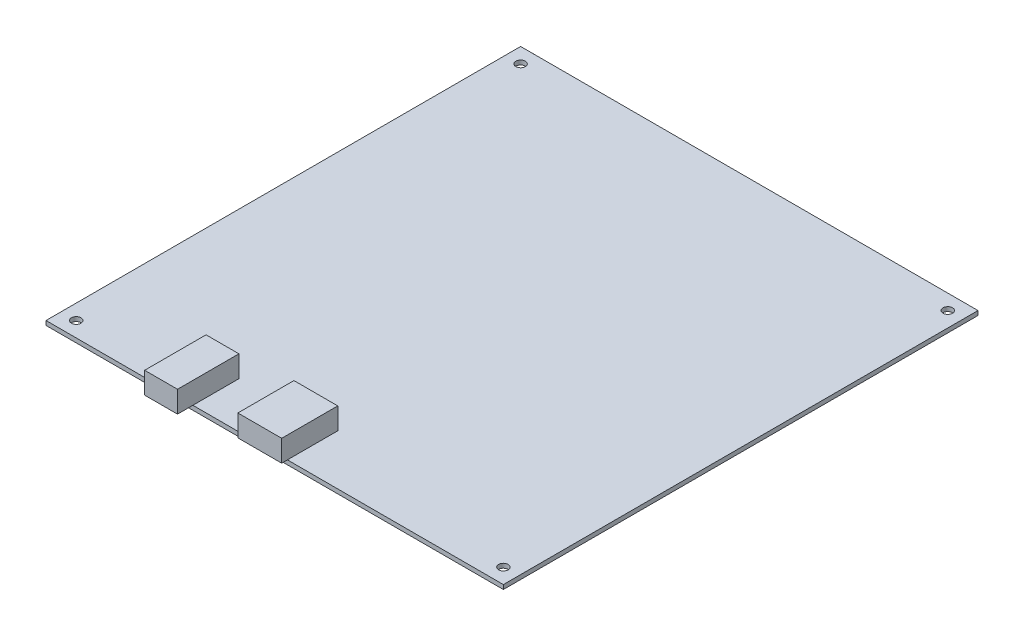
ISO-10303-21;
HEADER;
FILE_DESCRIPTION(('STEP AP214'),'2;1');
FILE_NAME('part.step','',(''),(''),'','','');
FILE_SCHEMA(('AUTOMOTIVE_DESIGN { 1 0 10303 214 1 1 1 1 }'));
ENDSEC;
DATA;
#1=APPLICATION_CONTEXT('core data for automotive mechanical design processes');
#2=APPLICATION_PROTOCOL_DEFINITION('international standard','automotive_design',2000,#1);
#3=PRODUCT_CONTEXT('',#1,'mechanical');
#4=PRODUCT('Part','Part','',(#3));
#5=PRODUCT_RELATED_PRODUCT_CATEGORY('part','',(#4));
#6=PRODUCT_DEFINITION_FORMATION('','',#4);
#7=PRODUCT_DEFINITION_CONTEXT('part definition',#1,'design');
#8=PRODUCT_DEFINITION('design','',#6,#7);
#9=PRODUCT_DEFINITION_SHAPE('','',#8);
#10=(LENGTH_UNIT() NAMED_UNIT(*) SI_UNIT(.MILLI.,.METRE.));
#11=(NAMED_UNIT(*) PLANE_ANGLE_UNIT() SI_UNIT($,.RADIAN.));
#12=(NAMED_UNIT(*) SI_UNIT($,.STERADIAN.) SOLID_ANGLE_UNIT());
#13=UNCERTAINTY_MEASURE_WITH_UNIT(LENGTH_MEASURE(1.E-05),#10,'distance_accuracy_value','');
#14=(GEOMETRIC_REPRESENTATION_CONTEXT(3) GLOBAL_UNCERTAINTY_ASSIGNED_CONTEXT((#13)) GLOBAL_UNIT_ASSIGNED_CONTEXT((#10,
#11,#12)) REPRESENTATION_CONTEXT('',''));
#15=CARTESIAN_POINT('',(0.,0.,0.));
#16=DIRECTION('',(0.,0.,1.));
#17=DIRECTION('',(1.,0.,0.));
#18=AXIS2_PLACEMENT_3D('',#15,#16,#17);
#19=CARTESIAN_POINT('',(-44.0442723681258,1.,10.0561799951606));
#20=DIRECTION('',(0.,1.,0.));
#21=DIRECTION('',(0.,0.,1.));
#22=AXIS2_PLACEMENT_3D('',#19,#20,#21);
#23=PLANE('',#22);
#24=CARTESIAN_POINT('',(58.4557276318742,1.,-96.4438200048394));
#25=DIRECTION('',(0.,1.,0.));
#26=DIRECTION('',(0.,0.,1.));
#27=AXIS2_PLACEMENT_3D('',#24,#25,#26);
#28=CIRCLE('',#27,1.10000000000001);
#29=CARTESIAN_POINT('',(58.4557276318742,1.,-95.3438200048394));
#30=VERTEX_POINT('',#29);
#31=EDGE_CURVE('E196',#30,#30,#28,.T.);
#32=ORIENTED_EDGE('',*,*,#31,.F.);
#33=EDGE_LOOP('',(#32));
#34=FACE_BOUND('',#33,.T.);
#35=CARTESIAN_POINT('',(58.4557276318742,1.,6.55617999516062));
#36=DIRECTION('',(0.,1.,0.));
#37=DIRECTION('',(0.,0.,1.));
#38=AXIS2_PLACEMENT_3D('',#35,#36,#37);
#39=CIRCLE('',#38,1.10000000000001);
#40=CARTESIAN_POINT('',(58.4557276318742,1.,7.65617999516062));
#41=VERTEX_POINT('',#40);
#42=EDGE_CURVE('E208',#41,#41,#39,.T.);
#43=ORIENTED_EDGE('',*,*,#42,.F.);
#44=EDGE_LOOP('',(#43));
#45=FACE_BOUND('',#44,.T.);
#46=CARTESIAN_POINT('',(-40.5442723681258,1.,6.55617999516062));
#47=DIRECTION('',(0.,1.,0.));
#48=DIRECTION('',(0.,0.,1.));
#49=AXIS2_PLACEMENT_3D('',#46,#47,#48);
#50=CIRCLE('',#49,1.10000000000001);
#51=CARTESIAN_POINT('',(-40.5442723681258,1.,7.65617999516063));
#52=VERTEX_POINT('',#51);
#53=EDGE_CURVE('E214',#52,#52,#50,.T.);
#54=ORIENTED_EDGE('',*,*,#53,.F.);
#55=EDGE_LOOP('',(#54));
#56=FACE_BOUND('',#55,.T.);
#57=CARTESIAN_POINT('',(-40.5442723681258,1.,-96.4438200048394));
#58=DIRECTION('',(0.,1.,0.));
#59=DIRECTION('',(0.,0.,1.));
#60=AXIS2_PLACEMENT_3D('',#57,#58,#59);
#61=CIRCLE('',#60,1.10000000000001);
#62=CARTESIAN_POINT('',(-40.5442723681258,1.,-95.3438200048394));
#63=VERTEX_POINT('',#62);
#64=EDGE_CURVE('E202',#63,#63,#61,.T.);
#65=ORIENTED_EDGE('',*,*,#64,.F.);
#66=EDGE_LOOP('',(#65));
#67=FACE_BOUND('',#66,.T.);
#68=DIRECTION('',(1.,0.,0.));
#69=VECTOR('',#68,1.);
#70=CARTESIAN_POINT('',(-44.0442723681258,1.,10.0561799951606));
#71=LINE('',#70,#69);
#72=CARTESIAN_POINT('',(-10.0042723681258,1.,10.0561799951606));
#73=VERTEX_POINT('',#72);
#74=CARTESIAN_POINT('',(1.74572763187419,1.,10.0561799951606));
#75=VERTEX_POINT('',#74);
#76=EDGE_CURVE('E272',#73,#75,#71,.T.);
#77=ORIENTED_EDGE('',*,*,#76,.T.);
#78=DIRECTION('',(0.,0.,1.));
#79=VECTOR('',#78,1.);
#80=CARTESIAN_POINT('',(1.74572763187418,1.,-1.61382000483938));
#81=LINE('',#80,#79);
#82=CARTESIAN_POINT('',(1.74572763187419,1.,-1.61382000483938));
#83=VERTEX_POINT('',#82);
#84=EDGE_CURVE('E56',#83,#75,#81,.T.);
#85=ORIENTED_EDGE('',*,*,#84,.F.);
#86=DIRECTION('',(-1.,0.,0.));
#87=VECTOR('',#86,1.);
#88=CARTESIAN_POINT('',(1.74572763187418,1.,-1.61382000483938));
#89=LINE('',#88,#87);
#90=CARTESIAN_POINT('',(11.9057276318742,1.,-1.61382000483938));
#91=VERTEX_POINT('',#90);
#92=EDGE_CURVE('E51',#91,#83,#89,.T.);
#93=ORIENTED_EDGE('',*,*,#92,.F.);
#94=DIRECTION('',(0.,0.,-1.));
#95=VECTOR('',#94,1.);
#96=CARTESIAN_POINT('',(11.9057276318742,1.,-1.61382000483938));
#97=LINE('',#96,#95);
#98=CARTESIAN_POINT('',(11.9057276318742,1.,10.0561799951606));
#99=VERTEX_POINT('',#98);
#100=EDGE_CURVE('E269',#99,#91,#97,.T.);
#101=ORIENTED_EDGE('',*,*,#100,.F.);
#102=CARTESIAN_POINT('',(61.9557276318742,1.,10.0561799951606));
#103=VERTEX_POINT('',#102);
#104=EDGE_CURVE('E223',#99,#103,#71,.T.);
#105=ORIENTED_EDGE('',*,*,#104,.T.);
#106=DIRECTION('',(0.,0.,-1.));
#107=VECTOR('',#106,1.);
#108=CARTESIAN_POINT('',(61.9557276318742,1.,-99.9438200048394));
#109=LINE('',#108,#107);
#110=CARTESIAN_POINT('',(61.9557276318742,1.,-99.9438200048394));
#111=VERTEX_POINT('',#110);
#112=EDGE_CURVE('E227',#103,#111,#109,.T.);
#113=ORIENTED_EDGE('',*,*,#112,.T.);
#114=DIRECTION('',(-1.,0.,0.));
#115=VECTOR('',#114,1.);
#116=CARTESIAN_POINT('',(-44.0442723681258,1.,-99.9438200048394));
#117=LINE('',#116,#115);
#118=CARTESIAN_POINT('',(-44.0442723681258,1.,-99.9438200048394));
#119=VERTEX_POINT('',#118);
#120=EDGE_CURVE('E230',#111,#119,#117,.T.);
#121=ORIENTED_EDGE('',*,*,#120,.T.);
#122=DIRECTION('',(0.,0.,1.));
#123=VECTOR('',#122,1.);
#124=CARTESIAN_POINT('',(-44.0442723681258,1.,-99.9438200048394));
#125=LINE('',#124,#123);
#126=CARTESIAN_POINT('',(-44.0442723681258,1.,10.0561799951606));
#127=VERTEX_POINT('',#126);
#128=EDGE_CURVE('E220',#119,#127,#125,.T.);
#129=ORIENTED_EDGE('',*,*,#128,.T.);
#130=CARTESIAN_POINT('',(-17.6242723681258,1.,10.0561799951606));
#131=VERTEX_POINT('',#130);
#132=EDGE_CURVE('E225',#127,#131,#71,.T.);
#133=ORIENTED_EDGE('',*,*,#132,.T.);
#134=DIRECTION('',(0.,0.,1.));
#135=VECTOR('',#134,1.);
#136=CARTESIAN_POINT('',(-17.6242723681258,1.,-0.613820004839382));
#137=LINE('',#136,#135);
#138=CARTESIAN_POINT('',(-17.6242723681258,1.,-0.613820004839382));
#139=VERTEX_POINT('',#138);
#140=EDGE_CURVE('E180',#139,#131,#137,.T.);
#141=ORIENTED_EDGE('',*,*,#140,.F.);
#142=DIRECTION('',(-1.,0.,0.));
#143=VECTOR('',#142,1.);
#144=CARTESIAN_POINT('',(-17.6242723681258,1.,-0.613820004839382));
#145=LINE('',#144,#143);
#146=CARTESIAN_POINT('',(-10.0042723681258,1.,-0.613820004839382));
#147=VERTEX_POINT('',#146);
#148=EDGE_CURVE('E173',#147,#139,#145,.T.);
#149=ORIENTED_EDGE('',*,*,#148,.F.);
#150=DIRECTION('',(0.,0.,-1.));
#151=VECTOR('',#150,1.);
#152=CARTESIAN_POINT('',(-10.0042723681258,1.,-0.613820004839382));
#153=LINE('',#152,#151);
#154=EDGE_CURVE('E12',#73,#147,#153,.T.);
#155=ORIENTED_EDGE('',*,*,#154,.F.);
#156=EDGE_LOOP('',(#77,#85,#93,#101,#105,#113,#121,#129,#133,#141,#149,#155));
#157=FACE_BOUND('',#156,.T.);
#158=ADVANCED_FACE('F35',(#34,#45,#56,#67,#157),#23,.T.);
#159=CARTESIAN_POINT('',(-44.0442723681258,0.,10.0561799951606));
#160=DIRECTION('',(0.,1.,0.));
#161=DIRECTION('',(0.,0.,1.));
#162=AXIS2_PLACEMENT_3D('',#159,#160,#161);
#163=PLANE('',#162);
#164=CARTESIAN_POINT('',(-40.5442723681258,0.,-96.4438200048394));
#165=DIRECTION('',(0.,1.,0.));
#166=DIRECTION('',(0.,0.,1.));
#167=AXIS2_PLACEMENT_3D('',#164,#165,#166);
#168=CIRCLE('',#167,1.10000000000001);
#169=CARTESIAN_POINT('',(-40.5442723681258,0.,-95.3438200048394));
#170=VERTEX_POINT('',#169);
#171=EDGE_CURVE('E199',#170,#170,#168,.T.);
#172=ORIENTED_EDGE('',*,*,#171,.T.);
#173=EDGE_LOOP('',(#172));
#174=FACE_BOUND('',#173,.T.);
#175=CARTESIAN_POINT('',(-40.5442723681258,0.,6.55617999516062));
#176=DIRECTION('',(0.,1.,0.));
#177=DIRECTION('',(0.,0.,1.));
#178=AXIS2_PLACEMENT_3D('',#175,#176,#177);
#179=CIRCLE('',#178,1.10000000000001);
#180=CARTESIAN_POINT('',(-40.5442723681258,0.,7.65617999516063));
#181=VERTEX_POINT('',#180);
#182=EDGE_CURVE('E211',#181,#181,#179,.T.);
#183=ORIENTED_EDGE('',*,*,#182,.T.);
#184=EDGE_LOOP('',(#183));
#185=FACE_BOUND('',#184,.T.);
#186=DIRECTION('',(0.,0.,1.));
#187=VECTOR('',#186,1.);
#188=CARTESIAN_POINT('',(-44.0442723681258,0.,-99.9438200048394));
#189=LINE('',#188,#187);
#190=CARTESIAN_POINT('',(-44.0442723681258,0.,-99.9438200048394));
#191=VERTEX_POINT('',#190);
#192=CARTESIAN_POINT('',(-44.0442723681258,0.,10.0561799951606));
#193=VERTEX_POINT('',#192);
#194=EDGE_CURVE('E217',#191,#193,#189,.T.);
#195=ORIENTED_EDGE('',*,*,#194,.F.);
#196=DIRECTION('',(-1.,0.,0.));
#197=VECTOR('',#196,1.);
#198=CARTESIAN_POINT('',(-44.0442723681258,0.,-99.9438200048394));
#199=LINE('',#198,#197);
#200=CARTESIAN_POINT('',(61.9557276318742,0.,-99.9438200048394));
#201=VERTEX_POINT('',#200);
#202=EDGE_CURVE('E224',#201,#191,#199,.T.);
#203=ORIENTED_EDGE('',*,*,#202,.F.);
#204=DIRECTION('',(0.,0.,-1.));
#205=VECTOR('',#204,1.);
#206=CARTESIAN_POINT('',(61.9557276318742,0.,-99.9438200048394));
#207=LINE('',#206,#205);
#208=CARTESIAN_POINT('',(61.9557276318742,0.,10.0561799951606));
#209=VERTEX_POINT('',#208);
#210=EDGE_CURVE('E237',#209,#201,#207,.T.);
#211=ORIENTED_EDGE('',*,*,#210,.F.);
#212=DIRECTION('',(1.,0.,0.));
#213=VECTOR('',#212,1.);
#214=CARTESIAN_POINT('',(-44.0442723681258,0.,10.0561799951606));
#215=LINE('',#214,#213);
#216=EDGE_CURVE('E235',#193,#209,#215,.T.);
#217=ORIENTED_EDGE('',*,*,#216,.F.);
#218=EDGE_LOOP('',(#195,#203,#211,#217));
#219=FACE_BOUND('',#218,.T.);
#220=CARTESIAN_POINT('',(58.4557276318742,0.,6.55617999516062));
#221=DIRECTION('',(0.,1.,0.));
#222=DIRECTION('',(0.,0.,1.));
#223=AXIS2_PLACEMENT_3D('',#220,#221,#222);
#224=CIRCLE('',#223,1.10000000000001);
#225=CARTESIAN_POINT('',(58.4557276318742,0.,7.65617999516062));
#226=VERTEX_POINT('',#225);
#227=EDGE_CURVE('E205',#226,#226,#224,.T.);
#228=ORIENTED_EDGE('',*,*,#227,.T.);
#229=EDGE_LOOP('',(#228));
#230=FACE_BOUND('',#229,.T.);
#231=CARTESIAN_POINT('',(58.4557276318742,0.,-96.4438200048394));
#232=DIRECTION('',(0.,1.,0.));
#233=DIRECTION('',(0.,0.,1.));
#234=AXIS2_PLACEMENT_3D('',#231,#232,#233);
#235=CIRCLE('',#234,1.10000000000001);
#236=CARTESIAN_POINT('',(58.4557276318742,0.,-95.3438200048394));
#237=VERTEX_POINT('',#236);
#238=EDGE_CURVE('E183',#237,#237,#235,.T.);
#239=ORIENTED_EDGE('',*,*,#238,.T.);
#240=EDGE_LOOP('',(#239));
#241=FACE_BOUND('',#240,.T.);
#242=ADVANCED_FACE('F259',(#174,#185,#219,#230,#241),#163,.F.);
#243=CARTESIAN_POINT('',(-44.0442723681258,1.,-99.9438200048394));
#244=DIRECTION('',(1.,0.,0.));
#245=DIRECTION('',(0.,0.,-1.));
#246=AXIS2_PLACEMENT_3D('',#243,#244,#245);
#247=PLANE('',#246);
#248=ORIENTED_EDGE('',*,*,#194,.T.);
#249=DIRECTION('',(0.,-1.,0.));
#250=VECTOR('',#249,1.);
#251=CARTESIAN_POINT('',(-44.0442723681258,1.,10.0561799951606));
#252=LINE('',#251,#250);
#253=EDGE_CURVE('E44',#127,#193,#252,.T.);
#254=ORIENTED_EDGE('',*,*,#253,.F.);
#255=ORIENTED_EDGE('',*,*,#128,.F.);
#256=DIRECTION('',(0.,-1.,0.));
#257=VECTOR('',#256,1.);
#258=CARTESIAN_POINT('',(-44.0442723681258,1.,-99.9438200048394));
#259=LINE('',#258,#257);
#260=EDGE_CURVE('E232',#119,#191,#259,.T.);
#261=ORIENTED_EDGE('',*,*,#260,.T.);
#262=EDGE_LOOP('',(#248,#254,#255,#261));
#263=FACE_BOUND('',#262,.T.);
#264=ADVANCED_FACE('F37',(#263),#247,.F.);
#265=CARTESIAN_POINT('',(-44.0442723681258,1.,10.0561799951606));
#266=DIRECTION('',(0.,0.,-1.));
#267=DIRECTION('',(-1.,0.,0.));
#268=AXIS2_PLACEMENT_3D('',#265,#266,#267);
#269=PLANE('',#268);
#270=ORIENTED_EDGE('',*,*,#216,.T.);
#271=DIRECTION('',(0.,-1.,0.));
#272=VECTOR('',#271,1.);
#273=CARTESIAN_POINT('',(61.9557276318742,1.,10.0561799951606));
#274=LINE('',#273,#272);
#275=EDGE_CURVE('E245',#103,#209,#274,.T.);
#276=ORIENTED_EDGE('',*,*,#275,.F.);
#277=ORIENTED_EDGE('',*,*,#104,.F.);
#278=EDGE_CURVE('E271',#75,#99,#71,.T.);
#279=ORIENTED_EDGE('',*,*,#278,.F.);
#280=ORIENTED_EDGE('',*,*,#76,.F.);
#281=EDGE_CURVE('E228',#131,#73,#71,.T.);
#282=ORIENTED_EDGE('',*,*,#281,.F.);
#283=ORIENTED_EDGE('',*,*,#132,.F.);
#284=ORIENTED_EDGE('',*,*,#253,.T.);
#285=EDGE_LOOP('',(#270,#276,#277,#279,#280,#282,#283,#284));
#286=FACE_BOUND('',#285,.T.);
#287=ADVANCED_FACE('F250',(#286),#269,.F.);
#288=CARTESIAN_POINT('',(61.9557276318742,1.,-99.9438200048394));
#289=DIRECTION('',(-1.,0.,0.));
#290=DIRECTION('',(0.,0.,1.));
#291=AXIS2_PLACEMENT_3D('',#288,#289,#290);
#292=PLANE('',#291);
#293=ORIENTED_EDGE('',*,*,#210,.T.);
#294=DIRECTION('',(0.,-1.,0.));
#295=VECTOR('',#294,1.);
#296=CARTESIAN_POINT('',(61.9557276318742,1.,-99.9438200048394));
#297=LINE('',#296,#295);
#298=EDGE_CURVE('E242',#111,#201,#297,.T.);
#299=ORIENTED_EDGE('',*,*,#298,.F.);
#300=ORIENTED_EDGE('',*,*,#112,.F.);
#301=ORIENTED_EDGE('',*,*,#275,.T.);
#302=EDGE_LOOP('',(#293,#299,#300,#301));
#303=FACE_BOUND('',#302,.T.);
#304=ADVANCED_FACE('F264',(#303),#292,.F.);
#305=CARTESIAN_POINT('',(-44.0442723681258,1.,-99.9438200048394));
#306=DIRECTION('',(0.,0.,1.));
#307=DIRECTION('',(1.,0.,0.));
#308=AXIS2_PLACEMENT_3D('',#305,#306,#307);
#309=PLANE('',#308);
#310=ORIENTED_EDGE('',*,*,#202,.T.);
#311=ORIENTED_EDGE('',*,*,#260,.F.);
#312=ORIENTED_EDGE('',*,*,#120,.F.);
#313=ORIENTED_EDGE('',*,*,#298,.T.);
#314=EDGE_LOOP('',(#310,#311,#312,#313));
#315=FACE_BOUND('',#314,.T.);
#316=ADVANCED_FACE('F268',(#315),#309,.F.);
#317=CARTESIAN_POINT('',(-40.5442723681258,1.,6.55617999516062));
#318=DIRECTION('',(0.,-1.,0.));
#319=DIRECTION('',(0.,0.,-1.));
#320=AXIS2_PLACEMENT_3D('',#317,#318,#319);
#321=CYLINDRICAL_SURFACE('',#320,1.10000000000001);
#322=ORIENTED_EDGE('',*,*,#53,.T.);
#323=EDGE_LOOP('',(#322));
#324=FACE_BOUND('',#323,.T.);
#325=ORIENTED_EDGE('',*,*,#182,.F.);
#326=EDGE_LOOP('',(#325));
#327=FACE_BOUND('',#326,.T.);
#328=ADVANCED_FACE('F353',(#324,#327),#321,.F.);
#329=CARTESIAN_POINT('',(58.4557276318742,1.,6.55617999516062));
#330=DIRECTION('',(0.,-1.,0.));
#331=DIRECTION('',(0.,0.,-1.));
#332=AXIS2_PLACEMENT_3D('',#329,#330,#331);
#333=CYLINDRICAL_SURFACE('',#332,1.10000000000001);
#334=ORIENTED_EDGE('',*,*,#42,.T.);
#335=EDGE_LOOP('',(#334));
#336=FACE_BOUND('',#335,.T.);
#337=ORIENTED_EDGE('',*,*,#227,.F.);
#338=EDGE_LOOP('',(#337));
#339=FACE_BOUND('',#338,.T.);
#340=ADVANCED_FACE('F396',(#336,#339),#333,.F.);
#341=CARTESIAN_POINT('',(-40.5442723681258,1.,-96.4438200048394));
#342=DIRECTION('',(0.,-1.,0.));
#343=DIRECTION('',(0.,0.,-1.));
#344=AXIS2_PLACEMENT_3D('',#341,#342,#343);
#345=CYLINDRICAL_SURFACE('',#344,1.10000000000001);
#346=ORIENTED_EDGE('',*,*,#64,.T.);
#347=EDGE_LOOP('',(#346));
#348=FACE_BOUND('',#347,.T.);
#349=ORIENTED_EDGE('',*,*,#171,.F.);
#350=EDGE_LOOP('',(#349));
#351=FACE_BOUND('',#350,.T.);
#352=ADVANCED_FACE('F404',(#348,#351),#345,.F.);
#353=CARTESIAN_POINT('',(58.4557276318742,1.,-96.4438200048394));
#354=DIRECTION('',(0.,-1.,0.));
#355=DIRECTION('',(0.,0.,-1.));
#356=AXIS2_PLACEMENT_3D('',#353,#354,#355);
#357=CYLINDRICAL_SURFACE('',#356,1.10000000000001);
#358=ORIENTED_EDGE('',*,*,#31,.T.);
#359=EDGE_LOOP('',(#358));
#360=FACE_BOUND('',#359,.T.);
#361=ORIENTED_EDGE('',*,*,#238,.F.);
#362=EDGE_LOOP('',(#361));
#363=FACE_BOUND('',#362,.T.);
#364=ADVANCED_FACE('F341',(#360,#363),#357,.F.);
#365=CARTESIAN_POINT('',(-39.5117966688814,1.,6.50117999516062));
#366=DIRECTION('',(0.,1.,0.));
#367=DIRECTION('',(0.,0.,1.));
#368=AXIS2_PLACEMENT_3D('',#365,#366,#367);
#369=PLANE('',#368);
#370=CARTESIAN_POINT('',(-17.6242723681258,1.,13.6161799951606));
#371=VERTEX_POINT('',#370);
#372=EDGE_CURVE('E184',#131,#371,#137,.T.);
#373=ORIENTED_EDGE('',*,*,#372,.F.);
#374=ORIENTED_EDGE('',*,*,#281,.T.);
#375=CARTESIAN_POINT('',(-10.0042723681258,1.,13.6161799951606));
#376=VERTEX_POINT('',#375);
#377=EDGE_CURVE('E283',#376,#73,#153,.T.);
#378=ORIENTED_EDGE('',*,*,#377,.F.);
#379=DIRECTION('',(1.,0.,0.));
#380=VECTOR('',#379,1.);
#381=CARTESIAN_POINT('',(-17.6242723681258,1.,13.6161799951606));
#382=LINE('',#381,#380);
#383=EDGE_CURVE('E316',#371,#376,#382,.T.);
#384=ORIENTED_EDGE('',*,*,#383,.F.);
#385=EDGE_LOOP('',(#373,#374,#378,#384));
#386=FACE_BOUND('',#385,.T.);
#387=ADVANCED_FACE('F281',(#386),#369,.F.);
#388=CARTESIAN_POINT('',(-39.5117966688814,6.,6.50117999516062));
#389=DIRECTION('',(0.,1.,0.));
#390=DIRECTION('',(0.,0.,1.));
#391=AXIS2_PLACEMENT_3D('',#388,#389,#390);
#392=PLANE('',#391);
#393=DIRECTION('',(-1.,0.,0.));
#394=VECTOR('',#393,1.);
#395=CARTESIAN_POINT('',(-17.6242723681258,6.,-0.613820004839382));
#396=LINE('',#395,#394);
#397=CARTESIAN_POINT('',(-10.0042723681258,6.,-0.613820004839382));
#398=VERTEX_POINT('',#397);
#399=CARTESIAN_POINT('',(-17.6242723681258,6.,-0.613820004839382));
#400=VERTEX_POINT('',#399);
#401=EDGE_CURVE('E161',#398,#400,#396,.T.);
#402=ORIENTED_EDGE('',*,*,#401,.T.);
#403=DIRECTION('',(0.,0.,1.));
#404=VECTOR('',#403,1.);
#405=CARTESIAN_POINT('',(-17.6242723681258,6.,-0.613820004839382));
#406=LINE('',#405,#404);
#407=CARTESIAN_POINT('',(-17.6242723681258,6.,13.6161799951606));
#408=VERTEX_POINT('',#407);
#409=EDGE_CURVE('E193',#400,#408,#406,.T.);
#410=ORIENTED_EDGE('',*,*,#409,.T.);
#411=DIRECTION('',(1.,0.,0.));
#412=VECTOR('',#411,1.);
#413=CARTESIAN_POINT('',(-17.6242723681258,6.,13.6161799951606));
#414=LINE('',#413,#412);
#415=CARTESIAN_POINT('',(-10.0042723681258,6.,13.6161799951606));
#416=VERTEX_POINT('',#415);
#417=EDGE_CURVE('E293',#408,#416,#414,.T.);
#418=ORIENTED_EDGE('',*,*,#417,.T.);
#419=DIRECTION('',(0.,0.,-1.));
#420=VECTOR('',#419,1.);
#421=CARTESIAN_POINT('',(-10.0042723681258,6.,-0.613820004839382));
#422=LINE('',#421,#420);
#423=EDGE_CURVE('E172',#416,#398,#422,.T.);
#424=ORIENTED_EDGE('',*,*,#423,.T.);
#425=EDGE_LOOP('',(#402,#410,#418,#424));
#426=FACE_BOUND('',#425,.T.);
#427=ADVANCED_FACE('F310',(#426),#392,.T.);
#428=CARTESIAN_POINT('',(-17.6242723681258,1.,-0.613820004839382));
#429=DIRECTION('',(0.,0.,-1.));
#430=DIRECTION('',(-1.,0.,0.));
#431=AXIS2_PLACEMENT_3D('',#428,#429,#430);
#432=PLANE('',#431);
#433=ORIENTED_EDGE('',*,*,#401,.F.);
#434=DIRECTION('',(0.,1.,0.));
#435=VECTOR('',#434,1.);
#436=CARTESIAN_POINT('',(-10.0042723681258,1.,-0.613820004839382));
#437=LINE('',#436,#435);
#438=EDGE_CURVE('E163',#147,#398,#437,.T.);
#439=ORIENTED_EDGE('',*,*,#438,.F.);
#440=ORIENTED_EDGE('',*,*,#148,.T.);
#441=DIRECTION('',(0.,1.,0.));
#442=VECTOR('',#441,1.);
#443=CARTESIAN_POINT('',(-17.6242723681258,1.,-0.613820004839382));
#444=LINE('',#443,#442);
#445=EDGE_CURVE('E169',#139,#400,#444,.T.);
#446=ORIENTED_EDGE('',*,*,#445,.T.);
#447=EDGE_LOOP('',(#433,#439,#440,#446));
#448=FACE_BOUND('',#447,.T.);
#449=ADVANCED_FACE('F306',(#448),#432,.T.);
#450=CARTESIAN_POINT('',(-10.0042723681258,1.,-0.613820004839382));
#451=DIRECTION('',(1.,0.,0.));
#452=DIRECTION('',(0.,0.,-1.));
#453=AXIS2_PLACEMENT_3D('',#450,#451,#452);
#454=PLANE('',#453);
#455=ORIENTED_EDGE('',*,*,#423,.F.);
#456=DIRECTION('',(0.,1.,0.));
#457=VECTOR('',#456,1.);
#458=CARTESIAN_POINT('',(-10.0042723681258,1.,13.6161799951606));
#459=LINE('',#458,#457);
#460=EDGE_CURVE('E291',#376,#416,#459,.T.);
#461=ORIENTED_EDGE('',*,*,#460,.F.);
#462=ORIENTED_EDGE('',*,*,#377,.T.);
#463=ORIENTED_EDGE('',*,*,#154,.T.);
#464=ORIENTED_EDGE('',*,*,#438,.T.);
#465=EDGE_LOOP('',(#455,#461,#462,#463,#464));
#466=FACE_BOUND('',#465,.T.);
#467=ADVANCED_FACE('F287',(#466),#454,.T.);
#468=CARTESIAN_POINT('',(-17.6242723681258,1.,13.6161799951606));
#469=DIRECTION('',(0.,0.,1.));
#470=DIRECTION('',(1.,0.,0.));
#471=AXIS2_PLACEMENT_3D('',#468,#469,#470);
#472=PLANE('',#471);
#473=ORIENTED_EDGE('',*,*,#417,.F.);
#474=DIRECTION('',(0.,1.,0.));
#475=VECTOR('',#474,1.);
#476=CARTESIAN_POINT('',(-17.6242723681258,1.,13.6161799951606));
#477=LINE('',#476,#475);
#478=EDGE_CURVE('E187',#371,#408,#477,.T.);
#479=ORIENTED_EDGE('',*,*,#478,.F.);
#480=ORIENTED_EDGE('',*,*,#383,.T.);
#481=ORIENTED_EDGE('',*,*,#460,.T.);
#482=EDGE_LOOP('',(#473,#479,#480,#481));
#483=FACE_BOUND('',#482,.T.);
#484=ADVANCED_FACE('F315',(#483),#472,.T.);
#485=CARTESIAN_POINT('',(-17.6242723681258,1.,-0.613820004839382));
#486=DIRECTION('',(-1.,0.,0.));
#487=DIRECTION('',(0.,0.,1.));
#488=AXIS2_PLACEMENT_3D('',#485,#486,#487);
#489=PLANE('',#488);
#490=ORIENTED_EDGE('',*,*,#409,.F.);
#491=ORIENTED_EDGE('',*,*,#445,.F.);
#492=ORIENTED_EDGE('',*,*,#140,.T.);
#493=ORIENTED_EDGE('',*,*,#372,.T.);
#494=ORIENTED_EDGE('',*,*,#478,.T.);
#495=EDGE_LOOP('',(#490,#491,#492,#493,#494));
#496=FACE_BOUND('',#495,.T.);
#497=ADVANCED_FACE('F329',(#496),#489,.T.);
#498=CARTESIAN_POINT('',(1.74572763187419,1.,11.3861799951606));
#499=DIRECTION('',(0.,1.,0.));
#500=DIRECTION('',(0.,0.,1.));
#501=AXIS2_PLACEMENT_3D('',#498,#499,#500);
#502=PLANE('',#501);
#503=CARTESIAN_POINT('',(1.74572763187419,1.,11.3861799951606));
#504=VERTEX_POINT('',#503);
#505=EDGE_CURVE('E159',#75,#504,#81,.T.);
#506=ORIENTED_EDGE('',*,*,#505,.F.);
#507=ORIENTED_EDGE('',*,*,#278,.T.);
#508=CARTESIAN_POINT('',(11.9057276318742,1.,11.3861799951606));
#509=VERTEX_POINT('',#508);
#510=EDGE_CURVE('E513',#509,#99,#97,.T.);
#511=ORIENTED_EDGE('',*,*,#510,.F.);
#512=DIRECTION('',(1.,0.,0.));
#513=VECTOR('',#512,1.);
#514=CARTESIAN_POINT('',(1.74572763187419,1.,11.3861799951606));
#515=LINE('',#514,#513);
#516=EDGE_CURVE('E519',#504,#509,#515,.T.);
#517=ORIENTED_EDGE('',*,*,#516,.F.);
#518=EDGE_LOOP('',(#506,#507,#511,#517));
#519=FACE_BOUND('',#518,.T.);
#520=ADVANCED_FACE('F331',(#519),#502,.F.);
#521=CARTESIAN_POINT('',(1.74572763187418,6.,-1.61382000483938));
#522=DIRECTION('',(1.,0.,0.));
#523=DIRECTION('',(0.,0.,-1.));
#524=AXIS2_PLACEMENT_3D('',#521,#522,#523);
#525=PLANE('',#524);
#526=ORIENTED_EDGE('',*,*,#84,.T.);
#527=ORIENTED_EDGE('',*,*,#505,.T.);
#528=DIRECTION('',(0.,-1.,0.));
#529=VECTOR('',#528,1.);
#530=CARTESIAN_POINT('',(1.74572763187419,6.,11.3861799951606));
#531=LINE('',#530,#529);
#532=CARTESIAN_POINT('',(1.74572763187419,6.,11.3861799951606));
#533=VERTEX_POINT('',#532);
#534=EDGE_CURVE('E141',#533,#504,#531,.T.);
#535=ORIENTED_EDGE('',*,*,#534,.F.);
#536=DIRECTION('',(0.,0.,1.));
#537=VECTOR('',#536,1.);
#538=CARTESIAN_POINT('',(1.74572763187418,6.,-1.61382000483938));
#539=LINE('',#538,#537);
#540=CARTESIAN_POINT('',(1.74572763187418,6.,-1.61382000483938));
#541=VERTEX_POINT('',#540);
#542=EDGE_CURVE('E147',#541,#533,#539,.T.);
#543=ORIENTED_EDGE('',*,*,#542,.F.);
#544=DIRECTION('',(0.,-1.,0.));
#545=VECTOR('',#544,1.);
#546=CARTESIAN_POINT('',(1.74572763187418,6.,-1.61382000483938));
#547=LINE('',#546,#545);
#548=EDGE_CURVE('E511',#541,#83,#547,.T.);
#549=ORIENTED_EDGE('',*,*,#548,.T.);
#550=EDGE_LOOP('',(#526,#527,#535,#543,#549));
#551=FACE_BOUND('',#550,.T.);
#552=ADVANCED_FACE('F157',(#551),#525,.F.);
#553=CARTESIAN_POINT('',(1.74572763187419,6.,11.3861799951606));
#554=DIRECTION('',(0.,0.,-1.));
#555=DIRECTION('',(-1.,0.,0.));
#556=AXIS2_PLACEMENT_3D('',#553,#554,#555);
#557=PLANE('',#556);
#558=ORIENTED_EDGE('',*,*,#516,.T.);
#559=DIRECTION('',(0.,-1.,0.));
#560=VECTOR('',#559,1.);
#561=CARTESIAN_POINT('',(11.9057276318742,6.,11.3861799951606));
#562=LINE('',#561,#560);
#563=CARTESIAN_POINT('',(11.9057276318742,6.,11.3861799951606));
#564=VERTEX_POINT('',#563);
#565=EDGE_CURVE('E143',#564,#509,#562,.T.);
#566=ORIENTED_EDGE('',*,*,#565,.F.);
#567=DIRECTION('',(1.,0.,0.));
#568=VECTOR('',#567,1.);
#569=CARTESIAN_POINT('',(1.74572763187419,6.,11.3861799951606));
#570=LINE('',#569,#568);
#571=EDGE_CURVE('E137',#533,#564,#570,.T.);
#572=ORIENTED_EDGE('',*,*,#571,.F.);
#573=ORIENTED_EDGE('',*,*,#534,.T.);
#574=EDGE_LOOP('',(#558,#566,#572,#573));
#575=FACE_BOUND('',#574,.T.);
#576=ADVANCED_FACE('F139',(#575),#557,.F.);
#577=CARTESIAN_POINT('',(11.9057276318742,6.,-1.61382000483938));
#578=DIRECTION('',(-1.,0.,0.));
#579=DIRECTION('',(0.,0.,1.));
#580=AXIS2_PLACEMENT_3D('',#577,#578,#579);
#581=PLANE('',#580);
#582=ORIENTED_EDGE('',*,*,#510,.T.);
#583=ORIENTED_EDGE('',*,*,#100,.T.);
#584=DIRECTION('',(0.,-1.,0.));
#585=VECTOR('',#584,1.);
#586=CARTESIAN_POINT('',(11.9057276318742,6.,-1.61382000483938));
#587=LINE('',#586,#585);
#588=CARTESIAN_POINT('',(11.9057276318742,6.,-1.61382000483938));
#589=VERTEX_POINT('',#588);
#590=EDGE_CURVE('E165',#589,#91,#587,.T.);
#591=ORIENTED_EDGE('',*,*,#590,.F.);
#592=DIRECTION('',(0.,0.,-1.));
#593=VECTOR('',#592,1.);
#594=CARTESIAN_POINT('',(11.9057276318742,6.,-1.61382000483938));
#595=LINE('',#594,#593);
#596=EDGE_CURVE('E146',#564,#589,#595,.T.);
#597=ORIENTED_EDGE('',*,*,#596,.F.);
#598=ORIENTED_EDGE('',*,*,#565,.T.);
#599=EDGE_LOOP('',(#582,#583,#591,#597,#598));
#600=FACE_BOUND('',#599,.T.);
#601=ADVANCED_FACE('F478',(#600),#581,.F.);
#602=CARTESIAN_POINT('',(1.74572763187418,6.,-1.61382000483938));
#603=DIRECTION('',(0.,0.,1.));
#604=DIRECTION('',(1.,0.,0.));
#605=AXIS2_PLACEMENT_3D('',#602,#603,#604);
#606=PLANE('',#605);
#607=ORIENTED_EDGE('',*,*,#92,.T.);
#608=ORIENTED_EDGE('',*,*,#548,.F.);
#609=DIRECTION('',(-1.,0.,0.));
#610=VECTOR('',#609,1.);
#611=CARTESIAN_POINT('',(1.74572763187418,6.,-1.61382000483938));
#612=LINE('',#611,#610);
#613=EDGE_CURVE('E152',#589,#541,#612,.T.);
#614=ORIENTED_EDGE('',*,*,#613,.F.);
#615=ORIENTED_EDGE('',*,*,#590,.T.);
#616=EDGE_LOOP('',(#607,#608,#614,#615));
#617=FACE_BOUND('',#616,.T.);
#618=ADVANCED_FACE('F486',(#617),#606,.F.);
#619=CARTESIAN_POINT('',(1.74572763187419,6.,11.3861799951606));
#620=DIRECTION('',(0.,1.,0.));
#621=DIRECTION('',(0.,0.,1.));
#622=AXIS2_PLACEMENT_3D('',#619,#620,#621);
#623=PLANE('',#622);
#624=ORIENTED_EDGE('',*,*,#542,.T.);
#625=ORIENTED_EDGE('',*,*,#571,.T.);
#626=ORIENTED_EDGE('',*,*,#596,.T.);
#627=ORIENTED_EDGE('',*,*,#613,.T.);
#628=EDGE_LOOP('',(#624,#625,#626,#627));
#629=FACE_BOUND('',#628,.T.);
#630=ADVANCED_FACE('F150',(#629),#623,.T.);
#631=CLOSED_SHELL('',(#158,#242,#264,#287,#304,#316,#328,#340,#352,#364,#387,#427,#449,#467,
#484,#497,#520,#552,#576,#601,#618,#630));
#632=MANIFOLD_SOLID_BREP('B2',#631);
#633=ADVANCED_BREP_SHAPE_REPRESENTATION('',(#18,#632),#14);
#634=SHAPE_DEFINITION_REPRESENTATION(#9,#633);
ENDSEC;
END-ISO-10303-21;
